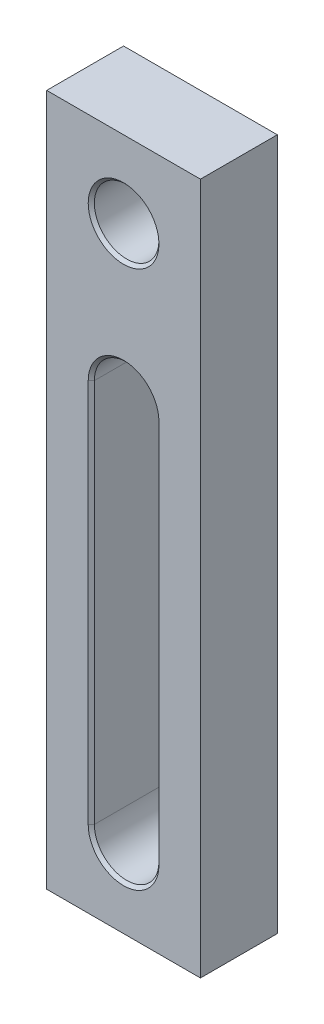
ISO-10303-21;
HEADER;
FILE_DESCRIPTION(('STEP AP214'),'2;1');
FILE_NAME('part.step','',(''),(''),'','','');
FILE_SCHEMA(('AUTOMOTIVE_DESIGN { 1 0 10303 214 1 1 1 1 }'));
ENDSEC;
DATA;
#1=APPLICATION_CONTEXT('core data for automotive mechanical design processes');
#2=APPLICATION_PROTOCOL_DEFINITION('international standard','automotive_design',2000,#1);
#3=PRODUCT_CONTEXT('',#1,'mechanical');
#4=PRODUCT('Part','Part','',(#3));
#5=PRODUCT_RELATED_PRODUCT_CATEGORY('part','',(#4));
#6=PRODUCT_DEFINITION_FORMATION('','',#4);
#7=PRODUCT_DEFINITION_CONTEXT('part definition',#1,'design');
#8=PRODUCT_DEFINITION('design','',#6,#7);
#9=PRODUCT_DEFINITION_SHAPE('','',#8);
#10=(LENGTH_UNIT() NAMED_UNIT(*) SI_UNIT(.MILLI.,.METRE.));
#11=(NAMED_UNIT(*) PLANE_ANGLE_UNIT() SI_UNIT($,.RADIAN.));
#12=(NAMED_UNIT(*) SI_UNIT($,.STERADIAN.) SOLID_ANGLE_UNIT());
#13=UNCERTAINTY_MEASURE_WITH_UNIT(LENGTH_MEASURE(1.E-05),#10,'distance_accuracy_value','');
#14=(GEOMETRIC_REPRESENTATION_CONTEXT(3) GLOBAL_UNCERTAINTY_ASSIGNED_CONTEXT((#13)) GLOBAL_UNIT_ASSIGNED_CONTEXT((#10,
#11,#12)) REPRESENTATION_CONTEXT('',''));
#15=CARTESIAN_POINT('',(0.,0.,0.));
#16=DIRECTION('',(0.,0.,1.));
#17=DIRECTION('',(1.,0.,0.));
#18=AXIS2_PLACEMENT_3D('',#15,#16,#17);
#19=CARTESIAN_POINT('',(0.,0.,25.));
#20=DIRECTION('',(1.,0.,0.));
#21=DIRECTION('',(0.,0.,-1.));
#22=AXIS2_PLACEMENT_3D('',#19,#20,#21);
#23=PLANE('',#22);
#24=DIRECTION('',(0.,-1.,0.));
#25=VECTOR('',#24,1.);
#26=CARTESIAN_POINT('',(0.,0.,0.));
#27=LINE('',#26,#25);
#28=CARTESIAN_POINT('',(0.,225.,0.));
#29=VERTEX_POINT('',#28);
#30=CARTESIAN_POINT('',(0.,0.,0.));
#31=VERTEX_POINT('',#30);
#32=EDGE_CURVE('E151',#29,#31,#27,.T.);
#33=ORIENTED_EDGE('',*,*,#32,.T.);
#34=DIRECTION('',(0.,0.,-1.));
#35=VECTOR('',#34,1.);
#36=CARTESIAN_POINT('',(0.,0.,25.));
#37=LINE('',#36,#35);
#38=CARTESIAN_POINT('',(0.,0.,25.));
#39=VERTEX_POINT('',#38);
#40=EDGE_CURVE('E132',#39,#31,#37,.T.);
#41=ORIENTED_EDGE('',*,*,#40,.F.);
#42=DIRECTION('',(0.,-1.,0.));
#43=VECTOR('',#42,1.);
#44=CARTESIAN_POINT('',(0.,0.,25.));
#45=LINE('',#44,#43);
#46=CARTESIAN_POINT('',(0.,225.,25.));
#47=VERTEX_POINT('',#46);
#48=EDGE_CURVE('E139',#47,#39,#45,.T.);
#49=ORIENTED_EDGE('',*,*,#48,.F.);
#50=DIRECTION('',(0.,0.,-1.));
#51=VECTOR('',#50,1.);
#52=CARTESIAN_POINT('',(0.,225.,25.));
#53=LINE('',#52,#51);
#54=EDGE_CURVE('E249',#47,#29,#53,.T.);
#55=ORIENTED_EDGE('',*,*,#54,.T.);
#56=EDGE_LOOP('',(#33,#41,#49,#55));
#57=FACE_BOUND('',#56,.T.);
#58=ADVANCED_FACE('F34',(#57),#23,.F.);
#59=CARTESIAN_POINT('',(0.,0.,25.));
#60=DIRECTION('',(0.,1.,0.));
#61=DIRECTION('',(0.,0.,1.));
#62=AXIS2_PLACEMENT_3D('',#59,#60,#61);
#63=PLANE('',#62);
#64=DIRECTION('',(1.,0.,0.));
#65=VECTOR('',#64,1.);
#66=CARTESIAN_POINT('',(0.,0.,0.));
#67=LINE('',#66,#65);
#68=CARTESIAN_POINT('',(50.,0.,0.));
#69=VERTEX_POINT('',#68);
#70=EDGE_CURVE('E251',#31,#69,#67,.T.);
#71=ORIENTED_EDGE('',*,*,#70,.T.);
#72=DIRECTION('',(0.,0.,-1.));
#73=VECTOR('',#72,1.);
#74=CARTESIAN_POINT('',(50.,0.,25.));
#75=LINE('',#74,#73);
#76=CARTESIAN_POINT('',(50.,0.,25.));
#77=VERTEX_POINT('',#76);
#78=EDGE_CURVE('E135',#77,#69,#75,.T.);
#79=ORIENTED_EDGE('',*,*,#78,.F.);
#80=DIRECTION('',(1.,0.,0.));
#81=VECTOR('',#80,1.);
#82=CARTESIAN_POINT('',(0.,0.,25.));
#83=LINE('',#82,#81);
#84=EDGE_CURVE('E128',#39,#77,#83,.T.);
#85=ORIENTED_EDGE('',*,*,#84,.F.);
#86=ORIENTED_EDGE('',*,*,#40,.T.);
#87=EDGE_LOOP('',(#71,#79,#85,#86));
#88=FACE_BOUND('',#87,.T.);
#89=ADVANCED_FACE('F130',(#88),#63,.F.);
#90=CARTESIAN_POINT('',(50.,0.,25.));
#91=DIRECTION('',(-1.,0.,0.));
#92=DIRECTION('',(0.,0.,1.));
#93=AXIS2_PLACEMENT_3D('',#90,#91,#92);
#94=PLANE('',#93);
#95=DIRECTION('',(0.,1.,0.));
#96=VECTOR('',#95,1.);
#97=CARTESIAN_POINT('',(50.,0.,0.));
#98=LINE('',#97,#96);
#99=CARTESIAN_POINT('',(50.,225.,0.));
#100=VERTEX_POINT('',#99);
#101=EDGE_CURVE('E253',#69,#100,#98,.T.);
#102=ORIENTED_EDGE('',*,*,#101,.T.);
#103=DIRECTION('',(0.,0.,-1.));
#104=VECTOR('',#103,1.);
#105=CARTESIAN_POINT('',(50.,225.,25.));
#106=LINE('',#105,#104);
#107=CARTESIAN_POINT('',(50.,225.,25.));
#108=VERTEX_POINT('',#107);
#109=EDGE_CURVE('E156',#108,#100,#106,.T.);
#110=ORIENTED_EDGE('',*,*,#109,.F.);
#111=DIRECTION('',(0.,1.,0.));
#112=VECTOR('',#111,1.);
#113=CARTESIAN_POINT('',(50.,0.,25.));
#114=LINE('',#113,#112);
#115=EDGE_CURVE('E138',#77,#108,#114,.T.);
#116=ORIENTED_EDGE('',*,*,#115,.F.);
#117=ORIENTED_EDGE('',*,*,#78,.T.);
#118=EDGE_LOOP('',(#102,#110,#116,#117));
#119=FACE_BOUND('',#118,.T.);
#120=ADVANCED_FACE('F265',(#119),#94,.F.);
#121=CARTESIAN_POINT('',(0.,225.,25.));
#122=DIRECTION('',(0.,-1.,0.));
#123=DIRECTION('',(0.,0.,-1.));
#124=AXIS2_PLACEMENT_3D('',#121,#122,#123);
#125=PLANE('',#124);
#126=DIRECTION('',(-1.,0.,0.));
#127=VECTOR('',#126,1.);
#128=CARTESIAN_POINT('',(0.,225.,0.));
#129=LINE('',#128,#127);
#130=EDGE_CURVE('E148',#100,#29,#129,.T.);
#131=ORIENTED_EDGE('',*,*,#130,.T.);
#132=ORIENTED_EDGE('',*,*,#54,.F.);
#133=DIRECTION('',(-1.,0.,0.));
#134=VECTOR('',#133,1.);
#135=CARTESIAN_POINT('',(0.,225.,25.));
#136=LINE('',#135,#134);
#137=EDGE_CURVE('E144',#108,#47,#136,.T.);
#138=ORIENTED_EDGE('',*,*,#137,.F.);
#139=ORIENTED_EDGE('',*,*,#109,.T.);
#140=EDGE_LOOP('',(#131,#132,#138,#139));
#141=FACE_BOUND('',#140,.T.);
#142=ADVANCED_FACE('F260',(#141),#125,.F.);
#143=CARTESIAN_POINT('',(0.,0.,25.));
#144=DIRECTION('',(0.,0.,-1.));
#145=DIRECTION('',(-1.,0.,0.));
#146=AXIS2_PLACEMENT_3D('',#143,#144,#145);
#147=PLANE('',#146);
#148=CARTESIAN_POINT('',(25.,200.,25.));
#149=DIRECTION('',(0.,0.,-1.));
#150=DIRECTION('',(-1.,0.,0.));
#151=AXIS2_PLACEMENT_3D('',#148,#149,#150);
#152=CIRCLE('',#151,11.5);
#153=CARTESIAN_POINT('',(13.5,200.,25.));
#154=VERTEX_POINT('',#153);
#155=EDGE_CURVE('E184',#154,#154,#152,.T.);
#156=ORIENTED_EDGE('',*,*,#155,.T.);
#157=EDGE_LOOP('',(#156));
#158=FACE_BOUND('',#157,.T.);
#159=CARTESIAN_POINT('',(25.,150.,25.));
#160=DIRECTION('',(0.,0.,-1.));
#161=DIRECTION('',(-1.,0.,0.));
#162=AXIS2_PLACEMENT_3D('',#159,#160,#161);
#163=CIRCLE('',#162,11.5);
#164=CARTESIAN_POINT('',(13.5,150.,25.));
#165=VERTEX_POINT('',#164);
#166=CARTESIAN_POINT('',(36.5,150.,25.));
#167=VERTEX_POINT('',#166);
#168=EDGE_CURVE('E179',#165,#167,#163,.T.);
#169=ORIENTED_EDGE('',*,*,#168,.T.);
#170=DIRECTION('',(0.,-1.,0.));
#171=VECTOR('',#170,1.);
#172=CARTESIAN_POINT('',(36.5,0.,25.));
#173=LINE('',#172,#171);
#174=CARTESIAN_POINT('',(36.5,25.,25.));
#175=VERTEX_POINT('',#174);
#176=EDGE_CURVE('E181',#167,#175,#173,.T.);
#177=ORIENTED_EDGE('',*,*,#176,.T.);
#178=CARTESIAN_POINT('',(25.,25.,25.));
#179=DIRECTION('',(0.,0.,-1.));
#180=DIRECTION('',(-1.,0.,0.));
#181=AXIS2_PLACEMENT_3D('',#178,#179,#180);
#182=CIRCLE('',#181,11.5);
#183=CARTESIAN_POINT('',(13.5,25.,25.));
#184=VERTEX_POINT('',#183);
#185=EDGE_CURVE('E177',#175,#184,#182,.T.);
#186=ORIENTED_EDGE('',*,*,#185,.T.);
#187=DIRECTION('',(0.,1.,0.));
#188=VECTOR('',#187,1.);
#189=CARTESIAN_POINT('',(13.5,0.,25.));
#190=LINE('',#189,#188);
#191=EDGE_CURVE('E175',#184,#165,#190,.T.);
#192=ORIENTED_EDGE('',*,*,#191,.T.);
#193=EDGE_LOOP('',(#169,#177,#186,#192));
#194=FACE_BOUND('',#193,.T.);
#195=ORIENTED_EDGE('',*,*,#48,.T.);
#196=ORIENTED_EDGE('',*,*,#84,.T.);
#197=ORIENTED_EDGE('',*,*,#115,.T.);
#198=ORIENTED_EDGE('',*,*,#137,.T.);
#199=EDGE_LOOP('',(#195,#196,#197,#198));
#200=FACE_BOUND('',#199,.T.);
#201=ADVANCED_FACE('F142',(#158,#194,#200),#147,.F.);
#202=CARTESIAN_POINT('',(0.,0.,0.));
#203=DIRECTION('',(0.,0.,-1.));
#204=DIRECTION('',(-1.,0.,0.));
#205=AXIS2_PLACEMENT_3D('',#202,#203,#204);
#206=PLANE('',#205);
#207=CARTESIAN_POINT('',(25.,200.,0.));
#208=DIRECTION('',(0.,0.,-1.));
#209=DIRECTION('',(-1.,0.,0.));
#210=AXIS2_PLACEMENT_3D('',#207,#208,#209);
#211=CIRCLE('',#210,11.5);
#212=CARTESIAN_POINT('',(13.5,200.,0.));
#213=VERTEX_POINT('',#212);
#214=EDGE_CURVE('E166',#213,#213,#211,.F.);
#215=ORIENTED_EDGE('',*,*,#214,.T.);
#216=EDGE_LOOP('',(#215));
#217=FACE_BOUND('',#216,.T.);
#218=CARTESIAN_POINT('',(25.,150.,0.));
#219=DIRECTION('',(0.,0.,-1.));
#220=DIRECTION('',(-1.,0.,0.));
#221=AXIS2_PLACEMENT_3D('',#218,#219,#220);
#222=CIRCLE('',#221,11.5);
#223=CARTESIAN_POINT('',(36.5000000000001,150.,0.));
#224=VERTEX_POINT('',#223);
#225=CARTESIAN_POINT('',(13.5,150.,0.));
#226=VERTEX_POINT('',#225);
#227=EDGE_CURVE('E154',#224,#226,#222,.F.);
#228=ORIENTED_EDGE('',*,*,#227,.T.);
#229=DIRECTION('',(0.,-1.,0.));
#230=VECTOR('',#229,1.);
#231=CARTESIAN_POINT('',(13.5,25.,0.));
#232=LINE('',#231,#230);
#233=CARTESIAN_POINT('',(13.5,25.,0.));
#234=VERTEX_POINT('',#233);
#235=EDGE_CURVE('E163',#226,#234,#232,.T.);
#236=ORIENTED_EDGE('',*,*,#235,.T.);
#237=CARTESIAN_POINT('',(25.,25.,0.));
#238=DIRECTION('',(0.,0.,-1.));
#239=DIRECTION('',(-1.,0.,0.));
#240=AXIS2_PLACEMENT_3D('',#237,#238,#239);
#241=CIRCLE('',#240,11.5);
#242=CARTESIAN_POINT('',(36.5000000000001,25.,0.));
#243=VERTEX_POINT('',#242);
#244=EDGE_CURVE('E161',#234,#243,#241,.F.);
#245=ORIENTED_EDGE('',*,*,#244,.T.);
#246=DIRECTION('',(0.,1.,0.));
#247=VECTOR('',#246,1.);
#248=CARTESIAN_POINT('',(36.5000000000001,150.,0.));
#249=LINE('',#248,#247);
#250=EDGE_CURVE('E152',#243,#224,#249,.T.);
#251=ORIENTED_EDGE('',*,*,#250,.T.);
#252=EDGE_LOOP('',(#228,#236,#245,#251));
#253=FACE_BOUND('',#252,.T.);
#254=ORIENTED_EDGE('',*,*,#32,.F.);
#255=ORIENTED_EDGE('',*,*,#130,.F.);
#256=ORIENTED_EDGE('',*,*,#101,.F.);
#257=ORIENTED_EDGE('',*,*,#70,.F.);
#258=EDGE_LOOP('',(#254,#255,#256,#257));
#259=FACE_BOUND('',#258,.T.);
#260=ADVANCED_FACE('F264',(#217,#253,#259),#206,.T.);
#261=CARTESIAN_POINT('',(25.,25.,0.));
#262=DIRECTION('',(0.,0.,1.));
#263=DIRECTION('',(1.,0.,0.));
#264=AXIS2_PLACEMENT_3D('',#261,#262,#263);
#265=CYLINDRICAL_SURFACE('',#264,10.5);
#266=DIRECTION('',(0.,0.,1.));
#267=VECTOR('',#266,1.);
#268=CARTESIAN_POINT('',(35.5,25.,0.));
#269=LINE('',#268,#267);
#270=CARTESIAN_POINT('',(35.5,25.,1.00000000000003));
#271=VERTEX_POINT('',#270);
#272=CARTESIAN_POINT('',(35.5,25.,24.));
#273=VERTEX_POINT('',#272);
#274=EDGE_CURVE('E211',#271,#273,#269,.T.);
#275=ORIENTED_EDGE('',*,*,#274,.F.);
#276=CARTESIAN_POINT('',(25.,25.,1.00000000000003));
#277=DIRECTION('',(0.,0.,-1.));
#278=DIRECTION('',(-1.,0.,0.));
#279=AXIS2_PLACEMENT_3D('',#276,#277,#278);
#280=CIRCLE('',#279,10.5);
#281=CARTESIAN_POINT('',(14.5,25.,1.00000000000003));
#282=VERTEX_POINT('',#281);
#283=EDGE_CURVE('E194',#271,#282,#280,.T.);
#284=ORIENTED_EDGE('',*,*,#283,.T.);
#285=DIRECTION('',(0.,0.,1.));
#286=VECTOR('',#285,1.);
#287=CARTESIAN_POINT('',(14.5,25.,0.));
#288=LINE('',#287,#286);
#289=CARTESIAN_POINT('',(14.5,25.,24.));
#290=VERTEX_POINT('',#289);
#291=EDGE_CURVE('E242',#282,#290,#288,.T.);
#292=ORIENTED_EDGE('',*,*,#291,.T.);
#293=CARTESIAN_POINT('',(25.,25.,24.));
#294=DIRECTION('',(0.,0.,-1.));
#295=DIRECTION('',(-1.,0.,0.));
#296=AXIS2_PLACEMENT_3D('',#293,#294,#295);
#297=CIRCLE('',#296,10.5);
#298=EDGE_CURVE('E192',#290,#273,#297,.F.);
#299=ORIENTED_EDGE('',*,*,#298,.T.);
#300=EDGE_LOOP('',(#275,#284,#292,#299));
#301=FACE_BOUND('',#300,.T.);
#302=ADVANCED_FACE('F363',(#301),#265,.F.);
#303=CARTESIAN_POINT('',(14.5,25.,0.));
#304=DIRECTION('',(-1.,0.,0.));
#305=DIRECTION('',(0.,0.,1.));
#306=AXIS2_PLACEMENT_3D('',#303,#304,#305);
#307=PLANE('',#306);
#308=ORIENTED_EDGE('',*,*,#291,.F.);
#309=DIRECTION('',(0.,1.,0.));
#310=VECTOR('',#309,1.);
#311=CARTESIAN_POINT('',(14.5,150.,1.00000000000003));
#312=LINE('',#311,#310);
#313=CARTESIAN_POINT('',(14.5,150.,1.00000000000003));
#314=VERTEX_POINT('',#313);
#315=EDGE_CURVE('E189',#282,#314,#312,.T.);
#316=ORIENTED_EDGE('',*,*,#315,.T.);
#317=DIRECTION('',(0.,0.,1.));
#318=VECTOR('',#317,1.);
#319=CARTESIAN_POINT('',(14.5,150.,0.));
#320=LINE('',#319,#318);
#321=CARTESIAN_POINT('',(14.5,150.,24.));
#322=VERTEX_POINT('',#321);
#323=EDGE_CURVE('E240',#314,#322,#320,.T.);
#324=ORIENTED_EDGE('',*,*,#323,.T.);
#325=DIRECTION('',(0.,-1.,0.));
#326=VECTOR('',#325,1.);
#327=CARTESIAN_POINT('',(14.5,25.,24.));
#328=LINE('',#327,#326);
#329=EDGE_CURVE('E187',#322,#290,#328,.T.);
#330=ORIENTED_EDGE('',*,*,#329,.T.);
#331=EDGE_LOOP('',(#308,#316,#324,#330));
#332=FACE_BOUND('',#331,.T.);
#333=ADVANCED_FACE('F356',(#332),#307,.F.);
#334=CARTESIAN_POINT('',(25.,150.,0.));
#335=DIRECTION('',(0.,0.,1.));
#336=DIRECTION('',(1.,0.,0.));
#337=AXIS2_PLACEMENT_3D('',#334,#335,#336);
#338=CYLINDRICAL_SURFACE('',#337,10.5);
#339=ORIENTED_EDGE('',*,*,#323,.F.);
#340=CARTESIAN_POINT('',(25.,150.,1.00000000000003));
#341=DIRECTION('',(0.,0.,-1.));
#342=DIRECTION('',(-1.,0.,0.));
#343=AXIS2_PLACEMENT_3D('',#340,#341,#342);
#344=CIRCLE('',#343,10.5);
#345=CARTESIAN_POINT('',(35.5,150.,1.00000000000003));
#346=VERTEX_POINT('',#345);
#347=EDGE_CURVE('E59',#314,#346,#344,.T.);
#348=ORIENTED_EDGE('',*,*,#347,.T.);
#349=DIRECTION('',(0.,0.,1.));
#350=VECTOR('',#349,1.);
#351=CARTESIAN_POINT('',(35.5,150.,0.));
#352=LINE('',#351,#350);
#353=CARTESIAN_POINT('',(35.5,150.,24.));
#354=VERTEX_POINT('',#353);
#355=EDGE_CURVE('E236',#346,#354,#352,.T.);
#356=ORIENTED_EDGE('',*,*,#355,.T.);
#357=CARTESIAN_POINT('',(25.,150.,24.));
#358=DIRECTION('',(0.,0.,-1.));
#359=DIRECTION('',(-1.,0.,0.));
#360=AXIS2_PLACEMENT_3D('',#357,#358,#359);
#361=CIRCLE('',#360,10.5);
#362=EDGE_CURVE('E196',#354,#322,#361,.F.);
#363=ORIENTED_EDGE('',*,*,#362,.T.);
#364=EDGE_LOOP('',(#339,#348,#356,#363));
#365=FACE_BOUND('',#364,.T.);
#366=ADVANCED_FACE('F239',(#365),#338,.F.);
#367=CARTESIAN_POINT('',(35.5,25.,0.));
#368=DIRECTION('',(1.,0.,0.));
#369=DIRECTION('',(0.,0.,-1.));
#370=AXIS2_PLACEMENT_3D('',#367,#368,#369);
#371=PLANE('',#370);
#372=ORIENTED_EDGE('',*,*,#355,.F.);
#373=DIRECTION('',(0.,-1.,0.));
#374=VECTOR('',#373,1.);
#375=CARTESIAN_POINT('',(35.5,25.,1.00000000000003));
#376=LINE('',#375,#374);
#377=EDGE_CURVE('E11',#346,#271,#376,.T.);
#378=ORIENTED_EDGE('',*,*,#377,.T.);
#379=ORIENTED_EDGE('',*,*,#274,.T.);
#380=DIRECTION('',(0.,1.,0.));
#381=VECTOR('',#380,1.);
#382=CARTESIAN_POINT('',(35.5,25.,24.));
#383=LINE('',#382,#381);
#384=EDGE_CURVE('E43',#273,#354,#383,.T.);
#385=ORIENTED_EDGE('',*,*,#384,.T.);
#386=EDGE_LOOP('',(#372,#378,#379,#385));
#387=FACE_BOUND('',#386,.T.);
#388=ADVANCED_FACE('F235',(#387),#371,.F.);
#389=CARTESIAN_POINT('',(25.,200.,0.));
#390=DIRECTION('',(0.,0.,1.));
#391=DIRECTION('',(1.,0.,0.));
#392=AXIS2_PLACEMENT_3D('',#389,#390,#391);
#393=CYLINDRICAL_SURFACE('',#392,10.5);
#394=CARTESIAN_POINT('',(25.,200.,0.999999999999999));
#395=DIRECTION('',(0.,0.,-1.));
#396=DIRECTION('',(-1.,0.,0.));
#397=AXIS2_PLACEMENT_3D('',#394,#395,#396);
#398=CIRCLE('',#397,10.5);
#399=CARTESIAN_POINT('',(14.5,200.,0.999999999999999));
#400=VERTEX_POINT('',#399);
#401=EDGE_CURVE('E172',#400,#400,#398,.T.);
#402=ORIENTED_EDGE('',*,*,#401,.T.);
#403=EDGE_LOOP('',(#402));
#404=FACE_BOUND('',#403,.T.);
#405=CARTESIAN_POINT('',(25.,200.,24.));
#406=DIRECTION('',(0.,0.,-1.));
#407=DIRECTION('',(-1.,0.,0.));
#408=AXIS2_PLACEMENT_3D('',#405,#406,#407);
#409=CIRCLE('',#408,10.5);
#410=CARTESIAN_POINT('',(14.5,200.,24.));
#411=VERTEX_POINT('',#410);
#412=EDGE_CURVE('E169',#411,#411,#409,.F.);
#413=ORIENTED_EDGE('',*,*,#412,.T.);
#414=EDGE_LOOP('',(#413));
#415=FACE_BOUND('',#414,.T.);
#416=ADVANCED_FACE('F283',(#404,#415),#393,.F.);
#417=CARTESIAN_POINT('',(25.,200.,0.));
#418=DIRECTION('',(0.,0.,-1.));
#419=DIRECTION('',(-1.,0.,0.));
#420=AXIS2_PLACEMENT_3D('',#417,#418,#419);
#421=CONICAL_SURFACE('',#420,11.5,0.785398163397453);
#422=ORIENTED_EDGE('',*,*,#401,.F.);
#423=EDGE_LOOP('',(#422));
#424=FACE_BOUND('',#423,.T.);
#425=ORIENTED_EDGE('',*,*,#214,.F.);
#426=EDGE_LOOP('',(#425));
#427=FACE_BOUND('',#426,.T.);
#428=ADVANCED_FACE('F279',(#424,#427),#421,.F.);
#429=CARTESIAN_POINT('',(25.,200.,24.));
#430=DIRECTION('',(0.,0.,1.));
#431=DIRECTION('',(1.,0.,0.));
#432=AXIS2_PLACEMENT_3D('',#429,#430,#431);
#433=CONICAL_SURFACE('',#432,10.5,0.785398163397459);
#434=ORIENTED_EDGE('',*,*,#155,.F.);
#435=EDGE_LOOP('',(#434));
#436=FACE_BOUND('',#435,.T.);
#437=ORIENTED_EDGE('',*,*,#412,.F.);
#438=EDGE_LOOP('',(#437));
#439=FACE_BOUND('',#438,.T.);
#440=ADVANCED_FACE('F282',(#436,#439),#433,.F.);
#441=CARTESIAN_POINT('',(36.5000000000001,0.,0.));
#442=DIRECTION('',(-0.707106781186548,0.,-0.707106781186548));
#443=DIRECTION('',(0.,-1.,0.));
#444=AXIS2_PLACEMENT_3D('',#441,#442,#443);
#445=PLANE('',#444);
#446=DIRECTION('',(0.707106781186548,0.,-0.707106781186548));
#447=VECTOR('',#446,1.);
#448=CARTESIAN_POINT('',(35.5,25.,1.00000000000003));
#449=LINE('',#448,#447);
#450=EDGE_CURVE('E205',#271,#243,#449,.T.);
#451=ORIENTED_EDGE('',*,*,#450,.F.);
#452=ORIENTED_EDGE('',*,*,#377,.F.);
#453=DIRECTION('',(-0.707106781186548,0.,0.707106781186548));
#454=VECTOR('',#453,1.);
#455=CARTESIAN_POINT('',(36.5000000000001,150.,0.));
#456=LINE('',#455,#454);
#457=EDGE_CURVE('E208',#224,#346,#456,.T.);
#458=ORIENTED_EDGE('',*,*,#457,.F.);
#459=ORIENTED_EDGE('',*,*,#250,.F.);
#460=EDGE_LOOP('',(#451,#452,#458,#459));
#461=FACE_BOUND('',#460,.T.);
#462=ADVANCED_FACE('F287',(#461),#445,.T.);
#463=CARTESIAN_POINT('',(25.,150.,0.));
#464=DIRECTION('',(0.,0.,-1.));
#465=DIRECTION('',(-1.,0.,0.));
#466=AXIS2_PLACEMENT_3D('',#463,#464,#465);
#467=CONICAL_SURFACE('',#466,11.5,0.785398163397448);
#468=ORIENTED_EDGE('',*,*,#457,.T.);
#469=ORIENTED_EDGE('',*,*,#347,.F.);
#470=DIRECTION('',(0.707106781186548,0.,0.707106781186548));
#471=VECTOR('',#470,1.);
#472=CARTESIAN_POINT('',(13.5,150.,0.));
#473=LINE('',#472,#471);
#474=EDGE_CURVE('E203',#226,#314,#473,.T.);
#475=ORIENTED_EDGE('',*,*,#474,.F.);
#476=ORIENTED_EDGE('',*,*,#227,.F.);
#477=EDGE_LOOP('',(#468,#469,#475,#476));
#478=FACE_BOUND('',#477,.T.);
#479=ADVANCED_FACE('F296',(#478),#467,.F.);
#480=CARTESIAN_POINT('',(25.,25.,0.));
#481=DIRECTION('',(0.,0.,-1.));
#482=DIRECTION('',(-1.,0.,0.));
#483=AXIS2_PLACEMENT_3D('',#480,#481,#482);
#484=CONICAL_SURFACE('',#483,11.5,0.785398163397447);
#485=ORIENTED_EDGE('',*,*,#450,.T.);
#486=ORIENTED_EDGE('',*,*,#244,.F.);
#487=DIRECTION('',(-0.707106781186547,0.,-0.707106781186548));
#488=VECTOR('',#487,1.);
#489=CARTESIAN_POINT('',(14.5,25.,1.00000000000003));
#490=LINE('',#489,#488);
#491=EDGE_CURVE('E201',#282,#234,#490,.T.);
#492=ORIENTED_EDGE('',*,*,#491,.F.);
#493=ORIENTED_EDGE('',*,*,#283,.F.);
#494=EDGE_LOOP('',(#485,#486,#492,#493));
#495=FACE_BOUND('',#494,.T.);
#496=ADVANCED_FACE('F292',(#495),#484,.F.);
#497=CARTESIAN_POINT('',(13.5,0.,0.));
#498=DIRECTION('',(0.707106781186548,0.,-0.707106781186548));
#499=DIRECTION('',(0.,1.,0.));
#500=AXIS2_PLACEMENT_3D('',#497,#498,#499);
#501=PLANE('',#500);
#502=ORIENTED_EDGE('',*,*,#474,.T.);
#503=ORIENTED_EDGE('',*,*,#315,.F.);
#504=ORIENTED_EDGE('',*,*,#491,.T.);
#505=ORIENTED_EDGE('',*,*,#235,.F.);
#506=EDGE_LOOP('',(#502,#503,#504,#505));
#507=FACE_BOUND('',#506,.T.);
#508=ADVANCED_FACE('F289',(#507),#501,.T.);
#509=CARTESIAN_POINT('',(14.5,25.,24.));
#510=DIRECTION('',(-0.707106781186547,0.,-0.707106781186547));
#511=DIRECTION('',(0.,-1.,0.));
#512=AXIS2_PLACEMENT_3D('',#509,#510,#511);
#513=PLANE('',#512);
#514=DIRECTION('',(0.707106781186547,0.,-0.707106781186547));
#515=VECTOR('',#514,1.);
#516=CARTESIAN_POINT('',(13.5,150.,25.));
#517=LINE('',#516,#515);
#518=EDGE_CURVE('E214',#165,#322,#517,.T.);
#519=ORIENTED_EDGE('',*,*,#518,.F.);
#520=ORIENTED_EDGE('',*,*,#191,.F.);
#521=DIRECTION('',(-0.707106781186547,0.,0.707106781186547));
#522=VECTOR('',#521,1.);
#523=CARTESIAN_POINT('',(14.5,25.,24.));
#524=LINE('',#523,#522);
#525=EDGE_CURVE('E38',#290,#184,#524,.T.);
#526=ORIENTED_EDGE('',*,*,#525,.F.);
#527=ORIENTED_EDGE('',*,*,#329,.F.);
#528=EDGE_LOOP('',(#519,#520,#526,#527));
#529=FACE_BOUND('',#528,.T.);
#530=ADVANCED_FACE('F36',(#529),#513,.F.);
#531=CARTESIAN_POINT('',(25.,25.,24.));
#532=DIRECTION('',(0.,0.,1.));
#533=DIRECTION('',(1.,0.,0.));
#534=AXIS2_PLACEMENT_3D('',#531,#532,#533);
#535=CONICAL_SURFACE('',#534,10.5,0.785398163397448);
#536=ORIENTED_EDGE('',*,*,#525,.T.);
#537=ORIENTED_EDGE('',*,*,#185,.F.);
#538=DIRECTION('',(0.707106781186547,0.,0.707106781186547));
#539=VECTOR('',#538,1.);
#540=CARTESIAN_POINT('',(35.5,25.,24.));
#541=LINE('',#540,#539);
#542=EDGE_CURVE('E213',#273,#175,#541,.T.);
#543=ORIENTED_EDGE('',*,*,#542,.F.);
#544=ORIENTED_EDGE('',*,*,#298,.F.);
#545=EDGE_LOOP('',(#536,#537,#543,#544));
#546=FACE_BOUND('',#545,.T.);
#547=ADVANCED_FACE('F224',(#546),#535,.F.);
#548=CARTESIAN_POINT('',(25.,150.,24.));
#549=DIRECTION('',(0.,0.,1.));
#550=DIRECTION('',(1.,0.,0.));
#551=AXIS2_PLACEMENT_3D('',#548,#549,#550);
#552=CONICAL_SURFACE('',#551,10.5,0.785398163397447);
#553=ORIENTED_EDGE('',*,*,#518,.T.);
#554=ORIENTED_EDGE('',*,*,#362,.F.);
#555=DIRECTION('',(-0.707106781186547,0.,-0.707106781186547));
#556=VECTOR('',#555,1.);
#557=CARTESIAN_POINT('',(36.5,150.,25.));
#558=LINE('',#557,#556);
#559=EDGE_CURVE('E51',#167,#354,#558,.T.);
#560=ORIENTED_EDGE('',*,*,#559,.F.);
#561=ORIENTED_EDGE('',*,*,#168,.F.);
#562=EDGE_LOOP('',(#553,#554,#560,#561));
#563=FACE_BOUND('',#562,.T.);
#564=ADVANCED_FACE('F231',(#563),#552,.F.);
#565=CARTESIAN_POINT('',(35.5,25.,24.));
#566=DIRECTION('',(0.707106781186547,0.,-0.707106781186547));
#567=DIRECTION('',(0.,1.,0.));
#568=AXIS2_PLACEMENT_3D('',#565,#566,#567);
#569=PLANE('',#568);
#570=ORIENTED_EDGE('',*,*,#542,.T.);
#571=ORIENTED_EDGE('',*,*,#176,.F.);
#572=ORIENTED_EDGE('',*,*,#559,.T.);
#573=ORIENTED_EDGE('',*,*,#384,.F.);
#574=EDGE_LOOP('',(#570,#571,#572,#573));
#575=FACE_BOUND('',#574,.T.);
#576=ADVANCED_FACE('F230',(#575),#569,.F.);
#577=CLOSED_SHELL('',(#58,#89,#120,#142,#201,#260,#302,#333,#366,#388,#416,#428,#440,#462,#479,
#496,#508,#530,#547,#564,#576));
#578=MANIFOLD_SOLID_BREP('B2',#577);
#579=ADVANCED_BREP_SHAPE_REPRESENTATION('',(#18,#578),#14);
#580=SHAPE_DEFINITION_REPRESENTATION(#9,#579);
ENDSEC;
END-ISO-10303-21;
